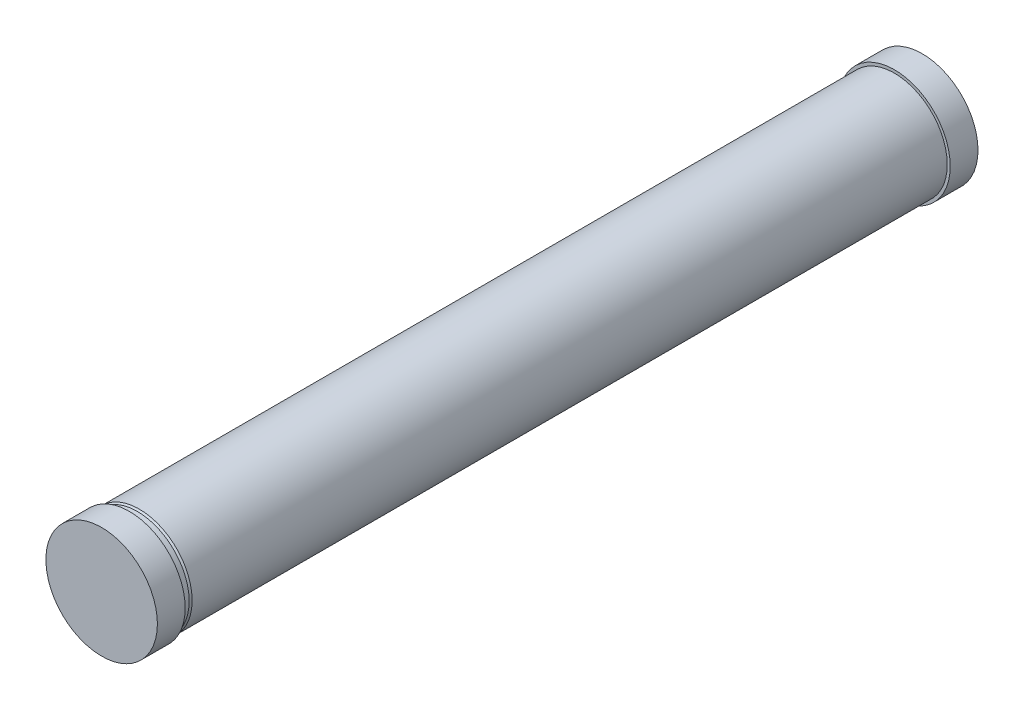
ISO-10303-21;
HEADER;
FILE_DESCRIPTION(('STEP AP214'),'2;1');
FILE_NAME('part.step','',(''),(''),'','','');
FILE_SCHEMA(('AUTOMOTIVE_DESIGN { 1 0 10303 214 1 1 1 1 }'));
ENDSEC;
DATA;
#1=APPLICATION_CONTEXT('core data for automotive mechanical design processes');
#2=APPLICATION_PROTOCOL_DEFINITION('international standard','automotive_design',2000,#1);
#3=PRODUCT_CONTEXT('',#1,'mechanical');
#4=PRODUCT('Part','Part','',(#3));
#5=PRODUCT_RELATED_PRODUCT_CATEGORY('part','',(#4));
#6=PRODUCT_DEFINITION_FORMATION('','',#4);
#7=PRODUCT_DEFINITION_CONTEXT('part definition',#1,'design');
#8=PRODUCT_DEFINITION('design','',#6,#7);
#9=PRODUCT_DEFINITION_SHAPE('','',#8);
#10=(LENGTH_UNIT() NAMED_UNIT(*) SI_UNIT(.MILLI.,.METRE.));
#11=(NAMED_UNIT(*) PLANE_ANGLE_UNIT() SI_UNIT($,.RADIAN.));
#12=(NAMED_UNIT(*) SI_UNIT($,.STERADIAN.) SOLID_ANGLE_UNIT());
#13=UNCERTAINTY_MEASURE_WITH_UNIT(LENGTH_MEASURE(1.E-05),#10,'distance_accuracy_value','');
#14=(GEOMETRIC_REPRESENTATION_CONTEXT(3) GLOBAL_UNCERTAINTY_ASSIGNED_CONTEXT((#13)) GLOBAL_UNIT_ASSIGNED_CONTEXT((#10,
#11,#12)) REPRESENTATION_CONTEXT('',''));
#15=CARTESIAN_POINT('',(0.,0.,0.));
#16=DIRECTION('',(0.,0.,1.));
#17=DIRECTION('',(1.,0.,0.));
#18=AXIS2_PLACEMENT_3D('',#15,#16,#17);
#19=CARTESIAN_POINT('',(0.,130.489816682547,0.));
#20=DIRECTION('',(0.,0.,-1.));
#21=DIRECTION('',(-1.,0.,0.));
#22=AXIS2_PLACEMENT_3D('',#19,#20,#21);
#23=PLANE('',#22);
#24=CARTESIAN_POINT('',(0.,-10.0101833174527,0.));
#25=DIRECTION('',(0.,0.,1.));
#26=DIRECTION('',(1.,0.,0.));
#27=AXIS2_PLACEMENT_3D('',#24,#25,#26);
#28=CIRCLE('',#27,140.5);
#29=CARTESIAN_POINT('',(140.5,-10.0101833174527,0.));
#30=VERTEX_POINT('',#29);
#31=EDGE_CURVE('E10',#30,#30,#28,.T.);
#32=ORIENTED_EDGE('',*,*,#31,.T.);
#33=EDGE_LOOP('',(#32));
#34=FACE_BOUND('',#33,.T.);
#35=ADVANCED_FACE('F30',(#34),#23,.F.);
#36=CARTESIAN_POINT('',(0.,-10.0101833174527,0.));
#37=DIRECTION('',(0.,0.,1.));
#38=DIRECTION('',(1.,0.,0.));
#39=AXIS2_PLACEMENT_3D('',#36,#37,#38);
#40=CYLINDRICAL_SURFACE('',#39,140.5);
#41=ORIENTED_EDGE('',*,*,#31,.F.);
#42=EDGE_LOOP('',(#41));
#43=FACE_BOUND('',#42,.T.);
#44=CARTESIAN_POINT('',(0.,-10.0101833174527,-70.));
#45=DIRECTION('',(0.,0.,1.));
#46=DIRECTION('',(1.,0.,0.));
#47=AXIS2_PLACEMENT_3D('',#44,#45,#46);
#48=CIRCLE('',#47,140.5);
#49=CARTESIAN_POINT('',(140.5,-10.0101833174527,-70.));
#50=VERTEX_POINT('',#49);
#51=EDGE_CURVE('E36',#50,#50,#48,.T.);
#52=ORIENTED_EDGE('',*,*,#51,.T.);
#53=EDGE_LOOP('',(#52));
#54=FACE_BOUND('',#53,.T.);
#55=ADVANCED_FACE('F74',(#43,#54),#40,.T.);
#56=CARTESIAN_POINT('',(0.,-10.0101833174527,-75.));
#57=DIRECTION('',(0.,0.,1.));
#58=DIRECTION('',(1.,0.,0.));
#59=AXIS2_PLACEMENT_3D('',#56,#57,#58);
#60=CONICAL_SURFACE('',#59,130.5,1.10714871779409);
#61=ORIENTED_EDGE('',*,*,#51,.F.);
#62=EDGE_LOOP('',(#61));
#63=FACE_BOUND('',#62,.T.);
#64=CARTESIAN_POINT('',(0.,-10.0101833174527,-75.));
#65=DIRECTION('',(0.,0.,1.));
#66=DIRECTION('',(1.,0.,0.));
#67=AXIS2_PLACEMENT_3D('',#64,#65,#66);
#68=CIRCLE('',#67,130.5);
#69=CARTESIAN_POINT('',(130.5,-10.0101833174527,-75.));
#70=VERTEX_POINT('',#69);
#71=EDGE_CURVE('E40',#70,#70,#68,.T.);
#72=ORIENTED_EDGE('',*,*,#71,.T.);
#73=EDGE_LOOP('',(#72));
#74=FACE_BOUND('',#73,.T.);
#75=ADVANCED_FACE('F78',(#63,#74),#60,.T.);
#76=CARTESIAN_POINT('',(0.,-10.0101833174527,0.));
#77=DIRECTION('',(0.,0.,1.));
#78=DIRECTION('',(1.,0.,0.));
#79=AXIS2_PLACEMENT_3D('',#76,#77,#78);
#80=CYLINDRICAL_SURFACE('',#79,130.5);
#81=ORIENTED_EDGE('',*,*,#71,.F.);
#82=EDGE_LOOP('',(#81));
#83=FACE_BOUND('',#82,.T.);
#84=CARTESIAN_POINT('',(0.,-10.0101833174527,-90.));
#85=DIRECTION('',(0.,0.,1.));
#86=DIRECTION('',(1.,0.,0.));
#87=AXIS2_PLACEMENT_3D('',#84,#85,#86);
#88=CIRCLE('',#87,130.5);
#89=CARTESIAN_POINT('',(130.5,-10.0101833174527,-90.));
#90=VERTEX_POINT('',#89);
#91=EDGE_CURVE('E44',#90,#90,#88,.T.);
#92=ORIENTED_EDGE('',*,*,#91,.T.);
#93=EDGE_LOOP('',(#92));
#94=FACE_BOUND('',#93,.T.);
#95=ADVANCED_FACE('F83',(#83,#94),#80,.T.);
#96=CARTESIAN_POINT('',(0.,-10.0101833174527,-95.));
#97=DIRECTION('',(0.,0.,-1.));
#98=DIRECTION('',(-1.,0.,0.));
#99=AXIS2_PLACEMENT_3D('',#96,#97,#98);
#100=CONICAL_SURFACE('',#99,133.,0.463647609000806);
#101=ORIENTED_EDGE('',*,*,#91,.F.);
#102=EDGE_LOOP('',(#101));
#103=FACE_BOUND('',#102,.T.);
#104=CARTESIAN_POINT('',(0.,-10.0101833174527,-95.));
#105=DIRECTION('',(0.,0.,1.));
#106=DIRECTION('',(1.,0.,0.));
#107=AXIS2_PLACEMENT_3D('',#104,#105,#106);
#108=CIRCLE('',#107,133.);
#109=CARTESIAN_POINT('',(133.,-10.0101833174527,-95.));
#110=VERTEX_POINT('',#109);
#111=EDGE_CURVE('E49',#110,#110,#108,.T.);
#112=ORIENTED_EDGE('',*,*,#111,.T.);
#113=EDGE_LOOP('',(#112));
#114=FACE_BOUND('',#113,.T.);
#115=ADVANCED_FACE('F89',(#103,#114),#100,.T.);
#116=CARTESIAN_POINT('',(0.,-10.0101833174527,0.));
#117=DIRECTION('',(0.,0.,1.));
#118=DIRECTION('',(1.,0.,0.));
#119=AXIS2_PLACEMENT_3D('',#116,#117,#118);
#120=CYLINDRICAL_SURFACE('',#119,133.);
#121=ORIENTED_EDGE('',*,*,#111,.F.);
#122=EDGE_LOOP('',(#121));
#123=FACE_BOUND('',#122,.T.);
#124=CARTESIAN_POINT('',(0.,-10.0101833174527,-1998.));
#125=DIRECTION('',(0.,0.,1.));
#126=DIRECTION('',(1.,0.,0.));
#127=AXIS2_PLACEMENT_3D('',#124,#125,#126);
#128=CIRCLE('',#127,133.);
#129=CARTESIAN_POINT('',(133.,-10.0101833174527,-1998.));
#130=VERTEX_POINT('',#129);
#131=EDGE_CURVE('E52',#130,#130,#128,.T.);
#132=ORIENTED_EDGE('',*,*,#131,.T.);
#133=EDGE_LOOP('',(#132));
#134=FACE_BOUND('',#133,.T.);
#135=ADVANCED_FACE('F93',(#123,#134),#120,.T.);
#136=CARTESIAN_POINT('',(0.,122.989816682547,-1998.));
#137=DIRECTION('',(0.,0.,-1.));
#138=DIRECTION('',(-1.,0.,0.));
#139=AXIS2_PLACEMENT_3D('',#136,#137,#138);
#140=PLANE('',#139);
#141=ORIENTED_EDGE('',*,*,#131,.F.);
#142=EDGE_LOOP('',(#141));
#143=FACE_BOUND('',#142,.T.);
#144=CARTESIAN_POINT('',(0.,-10.0101833174527,-1998.));
#145=DIRECTION('',(0.,0.,1.));
#146=DIRECTION('',(1.,0.,0.));
#147=AXIS2_PLACEMENT_3D('',#144,#145,#146);
#148=CIRCLE('',#147,140.5);
#149=CARTESIAN_POINT('',(140.5,-10.0101833174527,-1998.));
#150=VERTEX_POINT('',#149);
#151=EDGE_CURVE('E55',#150,#150,#148,.T.);
#152=ORIENTED_EDGE('',*,*,#151,.T.);
#153=EDGE_LOOP('',(#152));
#154=FACE_BOUND('',#153,.T.);
#155=ADVANCED_FACE('F70',(#143,#154),#140,.F.);
#156=CARTESIAN_POINT('',(0.,-10.0101833174527,0.));
#157=DIRECTION('',(0.,0.,1.));
#158=DIRECTION('',(1.,0.,0.));
#159=AXIS2_PLACEMENT_3D('',#156,#157,#158);
#160=CYLINDRICAL_SURFACE('',#159,140.5);
#161=ORIENTED_EDGE('',*,*,#151,.F.);
#162=EDGE_LOOP('',(#161));
#163=FACE_BOUND('',#162,.T.);
#164=CARTESIAN_POINT('',(0.,-10.0101833174527,-2068.));
#165=DIRECTION('',(0.,0.,1.));
#166=DIRECTION('',(1.,0.,0.));
#167=AXIS2_PLACEMENT_3D('',#164,#165,#166);
#168=CIRCLE('',#167,140.5);
#169=CARTESIAN_POINT('',(140.5,-10.0101833174527,-2068.));
#170=VERTEX_POINT('',#169);
#171=EDGE_CURVE('E58',#170,#170,#168,.T.);
#172=ORIENTED_EDGE('',*,*,#171,.T.);
#173=EDGE_LOOP('',(#172));
#174=FACE_BOUND('',#173,.T.);
#175=ADVANCED_FACE('F62',(#163,#174),#160,.T.);
#176=CARTESIAN_POINT('',(0.,130.489816682547,-2068.));
#177=DIRECTION('',(0.,0.,1.));
#178=DIRECTION('',(1.,0.,0.));
#179=AXIS2_PLACEMENT_3D('',#176,#177,#178);
#180=PLANE('',#179);
#181=ORIENTED_EDGE('',*,*,#171,.F.);
#182=EDGE_LOOP('',(#181));
#183=FACE_BOUND('',#182,.T.);
#184=ADVANCED_FACE('F64',(#183),#180,.F.);
#185=CLOSED_SHELL('',(#35,#55,#75,#95,#115,#135,#155,#175,#184));
#186=MANIFOLD_SOLID_BREP('B2',#185);
#187=ADVANCED_BREP_SHAPE_REPRESENTATION('',(#18,#186),#14);
#188=SHAPE_DEFINITION_REPRESENTATION(#9,#187);
ENDSEC;
END-ISO-10303-21;
